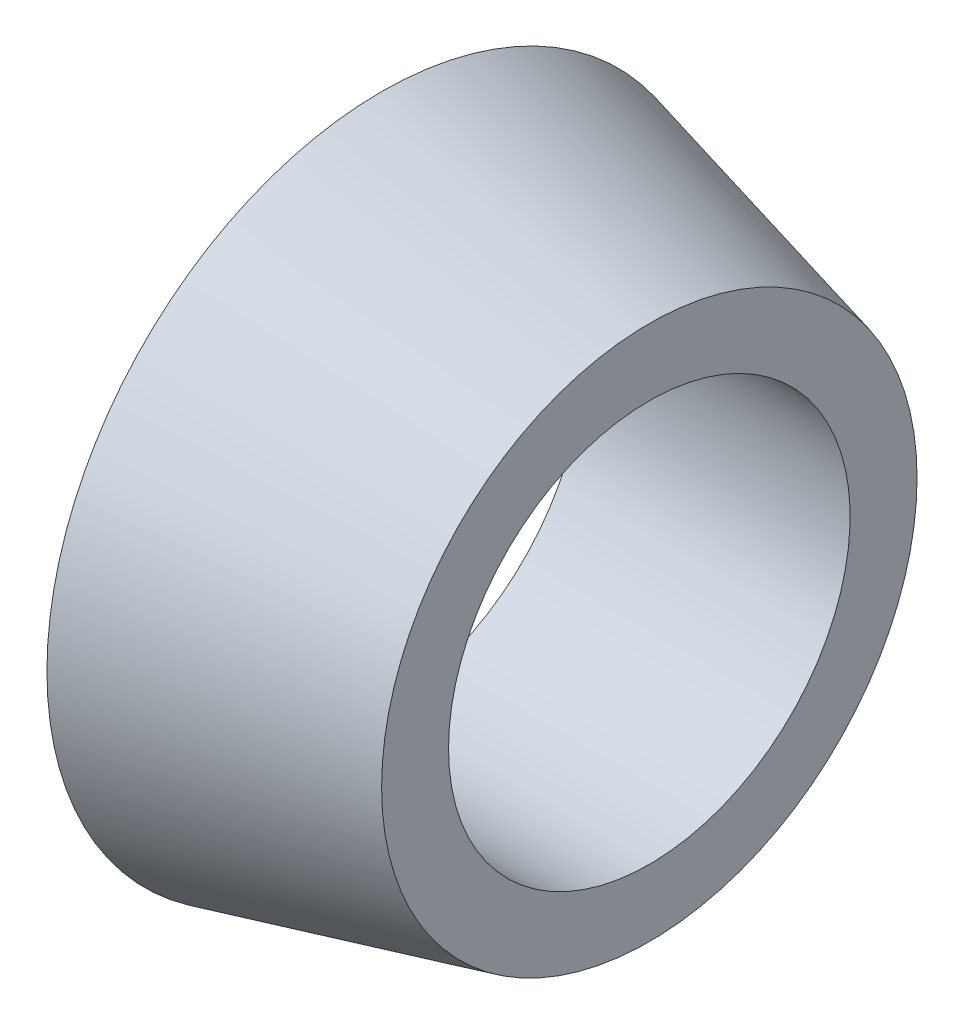
ISO-10303-21;
HEADER;
FILE_DESCRIPTION(('STEP AP214'),'2;1');
FILE_NAME('part.step','',(''),(''),'','','');
FILE_SCHEMA(('AUTOMOTIVE_DESIGN { 1 0 10303 214 1 1 1 1 }'));
ENDSEC;
DATA;
#1=APPLICATION_CONTEXT('core data for automotive mechanical design processes');
#2=APPLICATION_PROTOCOL_DEFINITION('international standard','automotive_design',2000,#1);
#3=PRODUCT_CONTEXT('',#1,'mechanical');
#4=PRODUCT('Part','Part','',(#3));
#5=PRODUCT_RELATED_PRODUCT_CATEGORY('part','',(#4));
#6=PRODUCT_DEFINITION_FORMATION('','',#4);
#7=PRODUCT_DEFINITION_CONTEXT('part definition',#1,'design');
#8=PRODUCT_DEFINITION('design','',#6,#7);
#9=PRODUCT_DEFINITION_SHAPE('','',#8);
#10=(LENGTH_UNIT() NAMED_UNIT(*) SI_UNIT(.MILLI.,.METRE.));
#11=(NAMED_UNIT(*) PLANE_ANGLE_UNIT() SI_UNIT($,.RADIAN.));
#12=(NAMED_UNIT(*) SI_UNIT($,.STERADIAN.) SOLID_ANGLE_UNIT());
#13=UNCERTAINTY_MEASURE_WITH_UNIT(LENGTH_MEASURE(1.E-05),#10,'distance_accuracy_value','');
#14=(GEOMETRIC_REPRESENTATION_CONTEXT(3) GLOBAL_UNCERTAINTY_ASSIGNED_CONTEXT((#13)) GLOBAL_UNIT_ASSIGNED_CONTEXT((#10,
#11,#12)) REPRESENTATION_CONTEXT('',''));
#15=CARTESIAN_POINT('',(0.,0.,0.));
#16=DIRECTION('',(0.,0.,1.));
#17=DIRECTION('',(1.,0.,0.));
#18=AXIS2_PLACEMENT_3D('',#15,#16,#17);
#19=CARTESIAN_POINT('',(0.,0.,0.));
#20=DIRECTION('',(-1.,0.,0.));
#21=DIRECTION('',(0.,0.,1.));
#22=AXIS2_PLACEMENT_3D('',#19,#20,#21);
#23=CYLINDRICAL_SURFACE('',#22,6.);
#24=CARTESIAN_POINT('',(8.,0.,0.));
#25=DIRECTION('',(-1.,0.,0.));
#26=DIRECTION('',(0.,0.,1.));
#27=AXIS2_PLACEMENT_3D('',#24,#25,#26);
#28=CIRCLE('',#27,6.);
#29=CARTESIAN_POINT('',(8.,0.,6.));
#30=VERTEX_POINT('',#29);
#31=EDGE_CURVE('E46',#30,#30,#28,.T.);
#32=ORIENTED_EDGE('',*,*,#31,.F.);
#33=EDGE_LOOP('',(#32));
#34=FACE_BOUND('',#33,.T.);
#35=CARTESIAN_POINT('',(0.,0.,0.));
#36=DIRECTION('',(-1.,0.,0.));
#37=DIRECTION('',(0.,0.,1.));
#38=AXIS2_PLACEMENT_3D('',#35,#36,#37);
#39=CIRCLE('',#38,6.);
#40=CARTESIAN_POINT('',(0.,0.,6.));
#41=VERTEX_POINT('',#40);
#42=EDGE_CURVE('E10',#41,#41,#39,.T.);
#43=ORIENTED_EDGE('',*,*,#42,.T.);
#44=EDGE_LOOP('',(#43));
#45=FACE_BOUND('',#44,.T.);
#46=ADVANCED_FACE('F32',(#34,#45),#23,.F.);
#47=CARTESIAN_POINT('',(0.,6.,0.));
#48=DIRECTION('',(1.,0.,0.));
#49=DIRECTION('',(0.,0.,-1.));
#50=AXIS2_PLACEMENT_3D('',#47,#48,#49);
#51=PLANE('',#50);
#52=ORIENTED_EDGE('',*,*,#42,.F.);
#53=EDGE_LOOP('',(#52));
#54=FACE_BOUND('',#53,.T.);
#55=CARTESIAN_POINT('',(0.,0.,0.));
#56=DIRECTION('',(-1.,0.,0.));
#57=DIRECTION('',(0.,0.,1.));
#58=AXIS2_PLACEMENT_3D('',#55,#56,#57);
#59=CIRCLE('',#58,10.);
#60=CARTESIAN_POINT('',(0.,0.,10.));
#61=VERTEX_POINT('',#60);
#62=EDGE_CURVE('E38',#61,#61,#59,.T.);
#63=ORIENTED_EDGE('',*,*,#62,.T.);
#64=EDGE_LOOP('',(#63));
#65=FACE_BOUND('',#64,.T.);
#66=ADVANCED_FACE('F55',(#54,#65),#51,.F.);
#67=CARTESIAN_POINT('',(8.,0.,0.));
#68=DIRECTION('',(-1.,0.,0.));
#69=DIRECTION('',(0.,0.,1.));
#70=AXIS2_PLACEMENT_3D('',#67,#68,#69);
#71=CONICAL_SURFACE('',#70,8.,0.244978663126864);
#72=ORIENTED_EDGE('',*,*,#62,.F.);
#73=EDGE_LOOP('',(#72));
#74=FACE_BOUND('',#73,.T.);
#75=CARTESIAN_POINT('',(8.,0.,0.));
#76=DIRECTION('',(-1.,0.,0.));
#77=DIRECTION('',(0.,0.,1.));
#78=AXIS2_PLACEMENT_3D('',#75,#76,#77);
#79=CIRCLE('',#78,8.);
#80=CARTESIAN_POINT('',(8.,0.,8.));
#81=VERTEX_POINT('',#80);
#82=EDGE_CURVE('E42',#81,#81,#79,.T.);
#83=ORIENTED_EDGE('',*,*,#82,.T.);
#84=EDGE_LOOP('',(#83));
#85=FACE_BOUND('',#84,.T.);
#86=ADVANCED_FACE('F59',(#74,#85),#71,.T.);
#87=CARTESIAN_POINT('',(8.,8.,0.));
#88=DIRECTION('',(-1.,0.,0.));
#89=DIRECTION('',(0.,0.,1.));
#90=AXIS2_PLACEMENT_3D('',#87,#88,#89);
#91=PLANE('',#90);
#92=ORIENTED_EDGE('',*,*,#82,.F.);
#93=EDGE_LOOP('',(#92));
#94=FACE_BOUND('',#93,.T.);
#95=ORIENTED_EDGE('',*,*,#31,.T.);
#96=EDGE_LOOP('',(#95));
#97=FACE_BOUND('',#96,.T.);
#98=ADVANCED_FACE('F52',(#94,#97),#91,.F.);
#99=CLOSED_SHELL('',(#46,#66,#86,#98));
#100=MANIFOLD_SOLID_BREP('B2',#99);
#101=ADVANCED_BREP_SHAPE_REPRESENTATION('',(#18,#100),#14);
#102=SHAPE_DEFINITION_REPRESENTATION(#9,#101);
ENDSEC;
END-ISO-10303-21;
